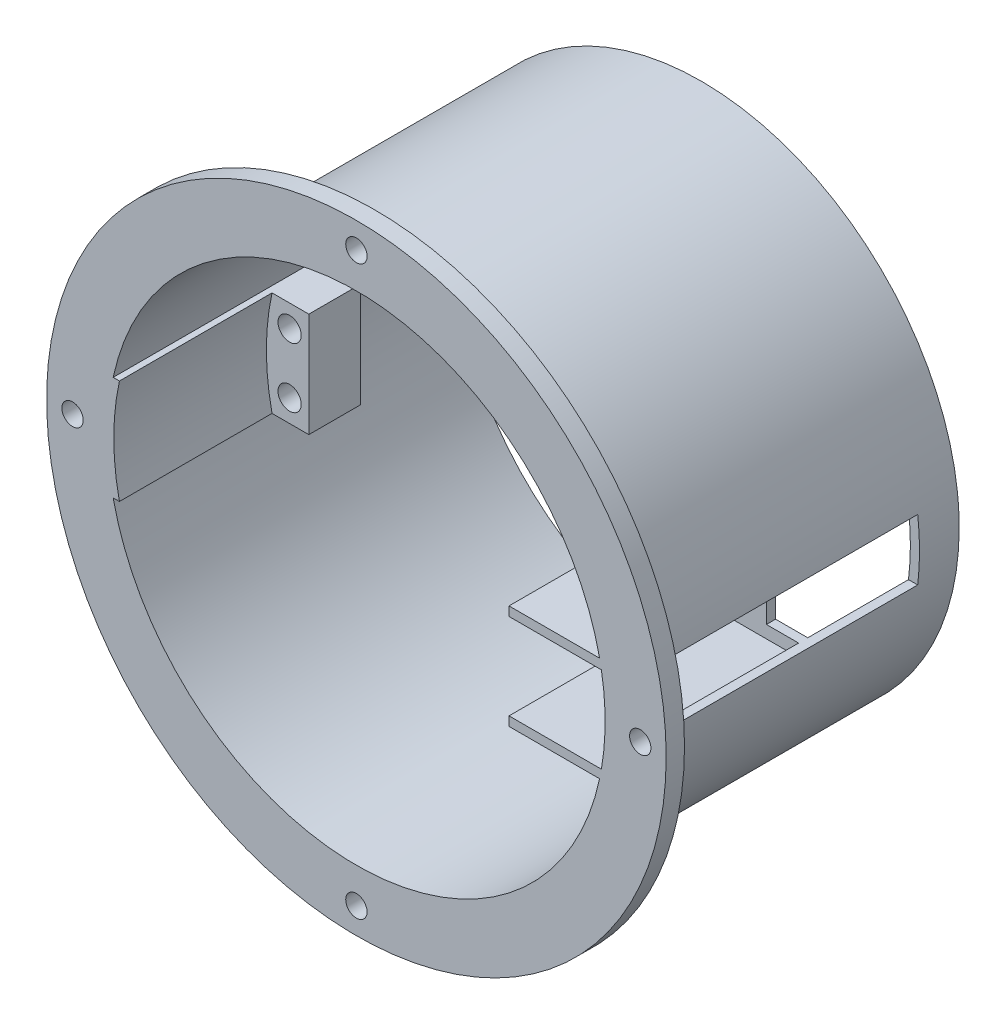
ISO-10303-21;
HEADER;
FILE_DESCRIPTION(('STEP AP214'),'2;1');
FILE_NAME('part.step','',(''),(''),'','','');
FILE_SCHEMA(('AUTOMOTIVE_DESIGN { 1 0 10303 214 1 1 1 1 }'));
ENDSEC;
DATA;
#1=APPLICATION_CONTEXT('core data for automotive mechanical design processes');
#2=APPLICATION_PROTOCOL_DEFINITION('international standard','automotive_design',2000,#1);
#3=PRODUCT_CONTEXT('',#1,'mechanical');
#4=PRODUCT('Part','Part','',(#3));
#5=PRODUCT_RELATED_PRODUCT_CATEGORY('part','',(#4));
#6=PRODUCT_DEFINITION_FORMATION('','',#4);
#7=PRODUCT_DEFINITION_CONTEXT('part definition',#1,'design');
#8=PRODUCT_DEFINITION('design','',#6,#7);
#9=PRODUCT_DEFINITION_SHAPE('','',#8);
#10=(LENGTH_UNIT() NAMED_UNIT(*) SI_UNIT(.MILLI.,.METRE.));
#11=(NAMED_UNIT(*) PLANE_ANGLE_UNIT() SI_UNIT($,.RADIAN.));
#12=(NAMED_UNIT(*) SI_UNIT($,.STERADIAN.) SOLID_ANGLE_UNIT());
#13=UNCERTAINTY_MEASURE_WITH_UNIT(LENGTH_MEASURE(1.E-05),#10,'distance_accuracy_value','');
#14=(GEOMETRIC_REPRESENTATION_CONTEXT(3) GLOBAL_UNCERTAINTY_ASSIGNED_CONTEXT((#13)) GLOBAL_UNIT_ASSIGNED_CONTEXT((#10,
#11,#12)) REPRESENTATION_CONTEXT('',''));
#15=CARTESIAN_POINT('',(0.,0.,0.));
#16=DIRECTION('',(0.,0.,1.));
#17=DIRECTION('',(1.,0.,0.));
#18=AXIS2_PLACEMENT_3D('',#15,#16,#17);
#19=CARTESIAN_POINT('',(0.,8.55,61.5));
#20=DIRECTION('',(0.,1.,0.));
#21=DIRECTION('',(0.,0.,1.));
#22=AXIS2_PLACEMENT_3D('',#19,#20,#21);
#23=PLANE('',#22);
#24=DIRECTION('',(0.,0.,-1.));
#25=VECTOR('',#24,1.);
#26=CARTESIAN_POINT('',(-32.79287166,8.55,112.118371577613));
#27=LINE('',#26,#25);
#28=CARTESIAN_POINT('',(-32.79287166,8.54999999999999,70.));
#29=VERTEX_POINT('',#28);
#30=CARTESIAN_POINT('',(-32.79287166,8.55,61.5));
#31=VERTEX_POINT('',#30);
#32=EDGE_CURVE('E57',#29,#31,#27,.T.);
#33=ORIENTED_EDGE('',*,*,#32,.T.);
#34=DIRECTION('',(-1.,0.,0.));
#35=VECTOR('',#34,1.);
#36=CARTESIAN_POINT('',(0.,8.55,61.5));
#37=LINE('',#36,#35);
#38=CARTESIAN_POINT('',(-39.842941658467,8.55,61.5));
#39=VERTEX_POINT('',#38);
#40=EDGE_CURVE('E235',#31,#39,#37,.T.);
#41=ORIENTED_EDGE('',*,*,#40,.T.);
#42=DIRECTION('',(0.,0.,1.));
#43=VECTOR('',#42,1.);
#44=CARTESIAN_POINT('',(-39.842941658467,8.55,61.5));
#45=LINE('',#44,#43);
#46=CARTESIAN_POINT('',(-39.842941658467,8.54999999999999,95.));
#47=VERTEX_POINT('',#46);
#48=EDGE_CURVE('E227',#39,#47,#45,.T.);
#49=ORIENTED_EDGE('',*,*,#48,.T.);
#50=DIRECTION('',(-1.,0.,0.));
#51=VECTOR('',#50,1.);
#52=CARTESIAN_POINT('',(-39.842941658467,8.54999999999999,95.));
#53=LINE('',#52,#51);
#54=CARTESIAN_POINT('',(-38.8195826870924,8.55,95.));
#55=VERTEX_POINT('',#54);
#56=EDGE_CURVE('E490',#55,#47,#53,.T.);
#57=ORIENTED_EDGE('',*,*,#56,.F.);
#58=DIRECTION('',(0.,0.,1.));
#59=VECTOR('',#58,1.);
#60=CARTESIAN_POINT('',(-38.8195826870924,8.55,52.791382652811));
#61=LINE('',#60,#59);
#62=CARTESIAN_POINT('',(-38.8195826870924,8.54999999999999,70.));
#63=VERTEX_POINT('',#62);
#64=EDGE_CURVE('E303',#63,#55,#61,.T.);
#65=ORIENTED_EDGE('',*,*,#64,.F.);
#66=DIRECTION('',(-1.,0.,0.));
#67=VECTOR('',#66,1.);
#68=CARTESIAN_POINT('',(-39.842941658467,8.54999999999999,70.));
#69=LINE('',#68,#67);
#70=EDGE_CURVE('E299',#29,#63,#69,.T.);
#71=ORIENTED_EDGE('',*,*,#70,.F.);
#72=EDGE_LOOP('',(#33,#41,#49,#57,#65,#71));
#73=FACE_BOUND('',#72,.T.);
#74=ADVANCED_FACE('F35',(#73),#23,.T.);
#75=CARTESIAN_POINT('',(0.,-8.55,61.5));
#76=DIRECTION('',(0.,1.,0.));
#77=DIRECTION('',(0.,0.,1.));
#78=AXIS2_PLACEMENT_3D('',#75,#76,#77);
#79=PLANE('',#78);
#80=DIRECTION('',(-1.,0.,0.));
#81=VECTOR('',#80,1.);
#82=CARTESIAN_POINT('',(0.,-8.55,61.5));
#83=LINE('',#82,#81);
#84=CARTESIAN_POINT('',(-32.79287166,-8.55,61.5));
#85=VERTEX_POINT('',#84);
#86=CARTESIAN_POINT('',(-39.842941658467,-8.55,61.5));
#87=VERTEX_POINT('',#86);
#88=EDGE_CURVE('E223',#85,#87,#83,.T.);
#89=ORIENTED_EDGE('',*,*,#88,.F.);
#90=DIRECTION('',(0.,0.,-1.));
#91=VECTOR('',#90,1.);
#92=CARTESIAN_POINT('',(-32.79287166,-8.55,112.118371577613));
#93=LINE('',#92,#91);
#94=CARTESIAN_POINT('',(-32.79287166,-8.55,70.));
#95=VERTEX_POINT('',#94);
#96=EDGE_CURVE('E281',#95,#85,#93,.T.);
#97=ORIENTED_EDGE('',*,*,#96,.F.);
#98=DIRECTION('',(1.,0.,0.));
#99=VECTOR('',#98,1.);
#100=CARTESIAN_POINT('',(-32.,-8.55,70.));
#101=LINE('',#100,#99);
#102=CARTESIAN_POINT('',(-38.8195826870924,-8.55,70.));
#103=VERTEX_POINT('',#102);
#104=EDGE_CURVE('E289',#103,#95,#101,.T.);
#105=ORIENTED_EDGE('',*,*,#104,.F.);
#106=DIRECTION('',(0.,0.,1.));
#107=VECTOR('',#106,1.);
#108=CARTESIAN_POINT('',(-38.8195826870924,-8.55,52.791382652811));
#109=LINE('',#108,#107);
#110=CARTESIAN_POINT('',(-38.8195826870924,-8.55,95.));
#111=VERTEX_POINT('',#110);
#112=EDGE_CURVE('E493',#103,#111,#109,.T.);
#113=ORIENTED_EDGE('',*,*,#112,.T.);
#114=DIRECTION('',(1.,0.,0.));
#115=VECTOR('',#114,1.);
#116=CARTESIAN_POINT('',(-39.842941658467,-8.55,95.));
#117=LINE('',#116,#115);
#118=CARTESIAN_POINT('',(-39.842941658467,-8.55,95.));
#119=VERTEX_POINT('',#118);
#120=EDGE_CURVE('E278',#119,#111,#117,.T.);
#121=ORIENTED_EDGE('',*,*,#120,.F.);
#122=DIRECTION('',(0.,0.,1.));
#123=VECTOR('',#122,1.);
#124=CARTESIAN_POINT('',(-39.842941658467,-8.55,61.5));
#125=LINE('',#124,#123);
#126=EDGE_CURVE('E222',#87,#119,#125,.T.);
#127=ORIENTED_EDGE('',*,*,#126,.F.);
#128=EDGE_LOOP('',(#89,#97,#105,#113,#121,#127));
#129=FACE_BOUND('',#128,.T.);
#130=ADVANCED_FACE('F288',(#129),#79,.F.);
#131=CARTESIAN_POINT('',(0.,0.,95.));
#132=DIRECTION('',(0.,0.,1.));
#133=DIRECTION('',(1.,0.,0.));
#134=AXIS2_PLACEMENT_3D('',#131,#132,#133);
#135=PLANE('',#134);
#136=CARTESIAN_POINT('',(46.5,0.,95.));
#137=DIRECTION('',(0.,0.,1.));
#138=DIRECTION('',(1.,0.,0.));
#139=AXIS2_PLACEMENT_3D('',#136,#137,#138);
#140=CIRCLE('',#139,1.75);
#141=CARTESIAN_POINT('',(48.25,0.,95.));
#142=VERTEX_POINT('',#141);
#143=EDGE_CURVE('E339',#142,#142,#140,.T.);
#144=ORIENTED_EDGE('',*,*,#143,.F.);
#145=EDGE_LOOP('',(#144));
#146=FACE_BOUND('',#145,.T.);
#147=CARTESIAN_POINT('',(0.,46.5,95.));
#148=DIRECTION('',(0.,0.,1.));
#149=DIRECTION('',(1.,0.,0.));
#150=AXIS2_PLACEMENT_3D('',#147,#148,#149);
#151=CIRCLE('',#150,1.75000000000005);
#152=CARTESIAN_POINT('',(1.75000000000006,46.5,95.));
#153=VERTEX_POINT('',#152);
#154=EDGE_CURVE('E336',#153,#153,#151,.T.);
#155=ORIENTED_EDGE('',*,*,#154,.F.);
#156=EDGE_LOOP('',(#155));
#157=FACE_BOUND('',#156,.T.);
#158=CARTESIAN_POINT('',(-46.5,-3.24707764512412E-13,95.));
#159=DIRECTION('',(0.,0.,1.));
#160=DIRECTION('',(1.,0.,0.));
#161=AXIS2_PLACEMENT_3D('',#158,#159,#160);
#162=CIRCLE('',#161,1.75000000000001);
#163=CARTESIAN_POINT('',(-44.75,-3.24707764512412E-13,95.));
#164=VERTEX_POINT('',#163);
#165=EDGE_CURVE('E333',#164,#164,#162,.T.);
#166=ORIENTED_EDGE('',*,*,#165,.F.);
#167=EDGE_LOOP('',(#166));
#168=FACE_BOUND('',#167,.T.);
#169=CARTESIAN_POINT('',(0.,-46.5,95.));
#170=DIRECTION('',(0.,0.,1.));
#171=DIRECTION('',(1.,0.,0.));
#172=AXIS2_PLACEMENT_3D('',#169,#170,#171);
#173=CIRCLE('',#172,1.75000000000015);
#174=CARTESIAN_POINT('',(1.75000000000013,-46.5,95.));
#175=VERTEX_POINT('',#174);
#176=EDGE_CURVE('E322',#175,#175,#173,.T.);
#177=ORIENTED_EDGE('',*,*,#176,.F.);
#178=EDGE_LOOP('',(#177));
#179=FACE_BOUND('',#178,.T.);
#180=CARTESIAN_POINT('',(0.,0.,95.));
#181=DIRECTION('',(0.,0.,1.));
#182=DIRECTION('',(1.,0.,0.));
#183=AXIS2_PLACEMENT_3D('',#180,#181,#182);
#184=CIRCLE('',#183,50.75);
#185=CARTESIAN_POINT('',(50.75,0.,95.));
#186=VERTEX_POINT('',#185);
#187=EDGE_CURVE('E345',#186,#186,#184,.T.);
#188=ORIENTED_EDGE('',*,*,#187,.T.);
#189=EDGE_LOOP('',(#188));
#190=FACE_BOUND('',#189,.T.);
#191=DIRECTION('',(1.,0.,0.));
#192=VECTOR('',#191,1.);
#193=CARTESIAN_POINT('',(0.,-8.55,95.));
#194=LINE('',#193,#192);
#195=CARTESIAN_POINT('',(25.,-8.55,95.));
#196=VERTEX_POINT('',#195);
#197=CARTESIAN_POINT('',(39.842941658467,-8.55,95.));
#198=VERTEX_POINT('',#197);
#199=EDGE_CURVE('E425',#196,#198,#194,.T.);
#200=ORIENTED_EDGE('',*,*,#199,.T.);
#201=CARTESIAN_POINT('',(0.,0.,95.));
#202=DIRECTION('',(0.,0.,1.));
#203=DIRECTION('',(1.,0.,0.));
#204=AXIS2_PLACEMENT_3D('',#201,#202,#203);
#205=CIRCLE('',#204,40.75);
#206=EDGE_CURVE('E415',#119,#198,#205,.T.);
#207=ORIENTED_EDGE('',*,*,#206,.F.);
#208=ORIENTED_EDGE('',*,*,#120,.T.);
#209=CARTESIAN_POINT('',(0.,0.,95.));
#210=DIRECTION('',(0.,0.,-1.));
#211=DIRECTION('',(1.,0.,0.));
#212=AXIS2_PLACEMENT_3D('',#209,#210,#211);
#213=CIRCLE('',#212,39.75);
#214=EDGE_CURVE('E487',#111,#55,#213,.T.);
#215=ORIENTED_EDGE('',*,*,#214,.T.);
#216=ORIENTED_EDGE('',*,*,#56,.T.);
#217=CARTESIAN_POINT('',(39.842941658467,8.54999999999999,95.));
#218=VERTEX_POINT('',#217);
#219=EDGE_CURVE('E411',#218,#47,#205,.T.);
#220=ORIENTED_EDGE('',*,*,#219,.F.);
#221=DIRECTION('',(-1.,0.,0.));
#222=VECTOR('',#221,1.);
#223=CARTESIAN_POINT('',(0.,8.55,95.));
#224=LINE('',#223,#222);
#225=CARTESIAN_POINT('',(25.,8.55,95.));
#226=VERTEX_POINT('',#225);
#227=EDGE_CURVE('E422',#218,#226,#224,.T.);
#228=ORIENTED_EDGE('',*,*,#227,.T.);
#229=DIRECTION('',(0.,1.,0.));
#230=VECTOR('',#229,1.);
#231=CARTESIAN_POINT('',(25.,0.,95.));
#232=LINE('',#231,#230);
#233=CARTESIAN_POINT('',(25.,7.04999999999999,95.));
#234=VERTEX_POINT('',#233);
#235=EDGE_CURVE('E250',#234,#226,#232,.T.);
#236=ORIENTED_EDGE('',*,*,#235,.F.);
#237=DIRECTION('',(-1.,0.,0.));
#238=VECTOR('',#237,1.);
#239=CARTESIAN_POINT('',(0.,7.04999999999999,95.));
#240=LINE('',#239,#238);
#241=CARTESIAN_POINT('',(40.1355204276711,7.04999999999999,95.));
#242=VERTEX_POINT('',#241);
#243=EDGE_CURVE('E419',#242,#234,#240,.T.);
#244=ORIENTED_EDGE('',*,*,#243,.F.);
#245=CARTESIAN_POINT('',(0.,0.,95.));
#246=DIRECTION('',(0.,0.,1.));
#247=DIRECTION('',(1.,0.,0.));
#248=AXIS2_PLACEMENT_3D('',#245,#246,#247);
#249=CIRCLE('',#248,40.75);
#250=CARTESIAN_POINT('',(40.1355204276711,-7.05,95.));
#251=VERTEX_POINT('',#250);
#252=EDGE_CURVE('E414',#251,#242,#249,.T.);
#253=ORIENTED_EDGE('',*,*,#252,.F.);
#254=DIRECTION('',(1.,0.,0.));
#255=VECTOR('',#254,1.);
#256=CARTESIAN_POINT('',(0.,-7.05,95.));
#257=LINE('',#256,#255);
#258=CARTESIAN_POINT('',(25.,-7.05,95.));
#259=VERTEX_POINT('',#258);
#260=EDGE_CURVE('E417',#259,#251,#257,.T.);
#261=ORIENTED_EDGE('',*,*,#260,.F.);
#262=EDGE_CURVE('E252',#196,#259,#232,.T.);
#263=ORIENTED_EDGE('',*,*,#262,.F.);
#264=EDGE_LOOP('',(#200,#207,#208,#215,#216,#220,#228,#236,#244,#253,#261,#263));
#265=FACE_BOUND('',#264,.T.);
#266=ADVANCED_FACE('F502',(#146,#157,#168,#179,#190,#265),#135,.T.);
#267=CARTESIAN_POINT('',(0.,0.,61.5));
#268=DIRECTION('',(0.,0.,-1.));
#269=DIRECTION('',(-1.,0.,0.));
#270=AXIS2_PLACEMENT_3D('',#267,#268,#269);
#271=CYLINDRICAL_SURFACE('',#270,42.25);
#272=CARTESIAN_POINT('',(0.,0.,38.5));
#273=DIRECTION('',(0.,0.,1.));
#274=DIRECTION('',(1.,0.,0.));
#275=AXIS2_PLACEMENT_3D('',#272,#273,#274);
#276=CIRCLE('',#275,42.25);
#277=CARTESIAN_POINT('',(42.25,0.,38.5));
#278=VERTEX_POINT('',#277);
#279=EDGE_CURVE('E247',#278,#278,#276,.T.);
#280=ORIENTED_EDGE('',*,*,#279,.T.);
#281=EDGE_LOOP('',(#280));
#282=FACE_BOUND('',#281,.T.);
#283=CARTESIAN_POINT('',(0.,0.,92.));
#284=DIRECTION('',(0.,0.,1.));
#285=DIRECTION('',(1.,0.,0.));
#286=AXIS2_PLACEMENT_3D('',#283,#284,#285);
#287=CIRCLE('',#286,42.25);
#288=CARTESIAN_POINT('',(41.953098812841,5.00000000000015,92.));
#289=VERTEX_POINT('',#288);
#290=CARTESIAN_POINT('',(41.953098812841,-4.99999999999985,92.));
#291=VERTEX_POINT('',#290);
#292=EDGE_CURVE('E349',#289,#291,#287,.T.);
#293=ORIENTED_EDGE('',*,*,#292,.F.);
#294=DIRECTION('',(0.,0.,-1.));
#295=VECTOR('',#294,1.);
#296=CARTESIAN_POINT('',(41.953098812841,5.00000000000015,61.5));
#297=LINE('',#296,#295);
#298=CARTESIAN_POINT('',(41.953098812841,5.00000000000015,45.));
#299=VERTEX_POINT('',#298);
#300=EDGE_CURVE('E384',#289,#299,#297,.T.);
#301=ORIENTED_EDGE('',*,*,#300,.T.);
#302=CARTESIAN_POINT('',(0.,0.,45.));
#303=DIRECTION('',(0.,0.,1.));
#304=DIRECTION('',(1.,0.,0.));
#305=AXIS2_PLACEMENT_3D('',#302,#303,#304);
#306=CIRCLE('',#305,42.25);
#307=CARTESIAN_POINT('',(41.953098812841,-4.99999999999985,45.));
#308=VERTEX_POINT('',#307);
#309=EDGE_CURVE('E389',#308,#299,#306,.T.);
#310=ORIENTED_EDGE('',*,*,#309,.F.);
#311=DIRECTION('',(0.,0.,-1.));
#312=VECTOR('',#311,1.);
#313=CARTESIAN_POINT('',(41.953098812841,-4.99999999999985,61.5));
#314=LINE('',#313,#312);
#315=EDGE_CURVE('E373',#308,#291,#314,.F.);
#316=ORIENTED_EDGE('',*,*,#315,.T.);
#317=EDGE_LOOP('',(#293,#301,#310,#316));
#318=FACE_BOUND('',#317,.T.);
#319=ADVANCED_FACE('F37',(#282,#318),#271,.T.);
#320=CARTESIAN_POINT('',(35.169284064653,5.00000000000015,45.));
#321=DIRECTION('',(0.,1.,0.));
#322=DIRECTION('',(0.,0.,1.));
#323=AXIS2_PLACEMENT_3D('',#320,#321,#322);
#324=PLANE('',#323);
#325=DIRECTION('',(1.,0.,0.));
#326=VECTOR('',#325,1.);
#327=CARTESIAN_POINT('',(35.169284064653,5.00000000000015,92.));
#328=LINE('',#327,#326);
#329=CARTESIAN_POINT('',(40.4420882250163,5.00000000000015,92.));
#330=VERTEX_POINT('',#329);
#331=EDGE_CURVE('E354',#330,#289,#328,.T.);
#332=ORIENTED_EDGE('',*,*,#331,.F.);
#333=DIRECTION('',(0.,0.,-1.));
#334=VECTOR('',#333,1.);
#335=CARTESIAN_POINT('',(40.4420882250163,5.00000000000015,95.));
#336=LINE('',#335,#334);
#337=CARTESIAN_POINT('',(40.4420882250163,5.00000000000015,63.));
#338=VERTEX_POINT('',#337);
#339=EDGE_CURVE('E376',#330,#338,#336,.T.);
#340=ORIENTED_EDGE('',*,*,#339,.T.);
#341=DIRECTION('',(-1.,0.,0.));
#342=VECTOR('',#341,1.);
#343=CARTESIAN_POINT('',(0.,5.00000000000015,63.));
#344=LINE('',#343,#342);
#345=CARTESIAN_POINT('',(35.169284064653,5.00000000000015,63.));
#346=VERTEX_POINT('',#345);
#347=EDGE_CURVE('E258',#338,#346,#344,.T.);
#348=ORIENTED_EDGE('',*,*,#347,.T.);
#349=DIRECTION('',(0.,0.,1.));
#350=VECTOR('',#349,1.);
#351=CARTESIAN_POINT('',(35.169284064653,5.00000000000015,45.));
#352=LINE('',#351,#350);
#353=CARTESIAN_POINT('',(35.169284064653,5.00000000000015,61.5));
#354=VERTEX_POINT('',#353);
#355=EDGE_CURVE('E363',#354,#346,#352,.T.);
#356=ORIENTED_EDGE('',*,*,#355,.F.);
#357=DIRECTION('',(-1.,0.,0.));
#358=VECTOR('',#357,1.);
#359=CARTESIAN_POINT('',(0.,5.00000000000015,61.5));
#360=LINE('',#359,#358);
#361=CARTESIAN_POINT('',(40.4420882250163,5.00000000000015,61.5));
#362=VERTEX_POINT('',#361);
#363=EDGE_CURVE('E381',#362,#354,#360,.T.);
#364=ORIENTED_EDGE('',*,*,#363,.F.);
#365=DIRECTION('',(0.,0.,-1.));
#366=VECTOR('',#365,1.);
#367=CARTESIAN_POINT('',(40.4420882250163,5.00000000000015,61.5));
#368=LINE('',#367,#366);
#369=CARTESIAN_POINT('',(40.4420882250163,5.00000000000015,45.));
#370=VERTEX_POINT('',#369);
#371=EDGE_CURVE('E378',#362,#370,#368,.T.);
#372=ORIENTED_EDGE('',*,*,#371,.T.);
#373=DIRECTION('',(-1.,0.,0.));
#374=VECTOR('',#373,1.);
#375=CARTESIAN_POINT('',(35.169284064653,5.00000000000015,45.));
#376=LINE('',#375,#374);
#377=EDGE_CURVE('E360',#299,#370,#376,.T.);
#378=ORIENTED_EDGE('',*,*,#377,.F.);
#379=ORIENTED_EDGE('',*,*,#300,.F.);
#380=EDGE_LOOP('',(#332,#340,#348,#356,#364,#372,#378,#379));
#381=FACE_BOUND('',#380,.T.);
#382=ADVANCED_FACE('F557',(#381),#324,.F.);
#383=CARTESIAN_POINT('',(35.169284064653,-4.99999999999985,45.));
#384=DIRECTION('',(0.,-1.,0.));
#385=DIRECTION('',(0.,0.,-1.));
#386=AXIS2_PLACEMENT_3D('',#383,#384,#385);
#387=PLANE('',#386);
#388=DIRECTION('',(-1.,0.,0.));
#389=VECTOR('',#388,1.);
#390=CARTESIAN_POINT('',(35.169284064653,-4.99999999999985,92.));
#391=LINE('',#390,#389);
#392=CARTESIAN_POINT('',(40.4420882250163,-4.99999999999985,92.));
#393=VERTEX_POINT('',#392);
#394=EDGE_CURVE('E263',#291,#393,#391,.T.);
#395=ORIENTED_EDGE('',*,*,#394,.F.);
#396=ORIENTED_EDGE('',*,*,#315,.F.);
#397=DIRECTION('',(1.,0.,0.));
#398=VECTOR('',#397,1.);
#399=CARTESIAN_POINT('',(35.169284064653,-4.99999999999985,45.));
#400=LINE('',#399,#398);
#401=CARTESIAN_POINT('',(40.4420882250163,-4.99999999999985,45.));
#402=VERTEX_POINT('',#401);
#403=EDGE_CURVE('E357',#402,#308,#400,.T.);
#404=ORIENTED_EDGE('',*,*,#403,.F.);
#405=DIRECTION('',(0.,0.,-1.));
#406=VECTOR('',#405,1.);
#407=CARTESIAN_POINT('',(40.4420882250163,-4.99999999999985,61.5));
#408=LINE('',#407,#406);
#409=CARTESIAN_POINT('',(40.4420882250163,-4.99999999999985,61.5));
#410=VERTEX_POINT('',#409);
#411=EDGE_CURVE('E369',#402,#410,#408,.F.);
#412=ORIENTED_EDGE('',*,*,#411,.T.);
#413=DIRECTION('',(1.,0.,0.));
#414=VECTOR('',#413,1.);
#415=CARTESIAN_POINT('',(0.,-4.99999999999985,61.5));
#416=LINE('',#415,#414);
#417=CARTESIAN_POINT('',(35.169284064653,-4.99999999999985,61.5));
#418=VERTEX_POINT('',#417);
#419=EDGE_CURVE('E371',#418,#410,#416,.T.);
#420=ORIENTED_EDGE('',*,*,#419,.F.);
#421=DIRECTION('',(0.,0.,1.));
#422=VECTOR('',#421,1.);
#423=CARTESIAN_POINT('',(35.169284064653,-4.99999999999985,45.));
#424=LINE('',#423,#422);
#425=CARTESIAN_POINT('',(35.169284064653,-4.99999999999985,63.));
#426=VERTEX_POINT('',#425);
#427=EDGE_CURVE('E362',#418,#426,#424,.T.);
#428=ORIENTED_EDGE('',*,*,#427,.T.);
#429=DIRECTION('',(1.,0.,0.));
#430=VECTOR('',#429,1.);
#431=CARTESIAN_POINT('',(0.,-4.99999999999985,63.));
#432=LINE('',#431,#430);
#433=CARTESIAN_POINT('',(40.4420882250163,-4.99999999999985,63.));
#434=VERTEX_POINT('',#433);
#435=EDGE_CURVE('E253',#426,#434,#432,.T.);
#436=ORIENTED_EDGE('',*,*,#435,.T.);
#437=DIRECTION('',(0.,0.,-1.));
#438=VECTOR('',#437,1.);
#439=CARTESIAN_POINT('',(40.4420882250163,-4.99999999999985,95.));
#440=LINE('',#439,#438);
#441=EDGE_CURVE('E366',#434,#393,#440,.F.);
#442=ORIENTED_EDGE('',*,*,#441,.T.);
#443=EDGE_LOOP('',(#395,#396,#404,#412,#420,#428,#436,#442));
#444=FACE_BOUND('',#443,.T.);
#445=ADVANCED_FACE('F549',(#444),#387,.F.);
#446=CARTESIAN_POINT('',(0.,0.,61.5));
#447=DIRECTION('',(0.,0.,1.));
#448=DIRECTION('',(1.,0.,0.));
#449=AXIS2_PLACEMENT_3D('',#446,#447,#448);
#450=PLANE('',#449);
#451=CARTESIAN_POINT('',(14.94287166,-4.9,61.5));
#452=DIRECTION('',(0.,0.,-1.));
#453=DIRECTION('',(-1.,0.,0.));
#454=AXIS2_PLACEMENT_3D('',#451,#452,#453);
#455=CIRCLE('',#454,1.9);
#456=CARTESIAN_POINT('',(13.04287166,-4.9,61.5));
#457=VERTEX_POINT('',#456);
#458=EDGE_CURVE('E475',#457,#457,#455,.T.);
#459=ORIENTED_EDGE('',*,*,#458,.F.);
#460=EDGE_LOOP('',(#459));
#461=FACE_BOUND('',#460,.T.);
#462=CARTESIAN_POINT('',(14.94287166,4.9,61.5));
#463=DIRECTION('',(0.,0.,-1.));
#464=DIRECTION('',(-1.,0.,0.));
#465=AXIS2_PLACEMENT_3D('',#462,#463,#464);
#466=CIRCLE('',#465,1.9);
#467=CARTESIAN_POINT('',(13.04287166,4.9,61.5));
#468=VERTEX_POINT('',#467);
#469=EDGE_CURVE('E270',#468,#468,#466,.T.);
#470=ORIENTED_EDGE('',*,*,#469,.F.);
#471=EDGE_LOOP('',(#470));
#472=FACE_BOUND('',#471,.T.);
#473=DIRECTION('',(1.,0.,0.));
#474=VECTOR('',#473,1.);
#475=CARTESIAN_POINT('',(0.,-8.55,61.5));
#476=LINE('',#475,#474);
#477=CARTESIAN_POINT('',(11.79287166,-8.55,61.5));
#478=VERTEX_POINT('',#477);
#479=CARTESIAN_POINT('',(39.842941658467,-8.55,61.5));
#480=VERTEX_POINT('',#479);
#481=EDGE_CURVE('E211',#478,#480,#476,.T.);
#482=ORIENTED_EDGE('',*,*,#481,.F.);
#483=DIRECTION('',(0.,-1.,0.));
#484=VECTOR('',#483,1.);
#485=CARTESIAN_POINT('',(11.79287166,8.54999999999999,61.5));
#486=LINE('',#485,#484);
#487=CARTESIAN_POINT('',(11.79287166,8.54999999999999,61.5));
#488=VERTEX_POINT('',#487);
#489=EDGE_CURVE('E199',#488,#478,#486,.T.);
#490=ORIENTED_EDGE('',*,*,#489,.F.);
#491=DIRECTION('',(1.,0.,0.));
#492=VECTOR('',#491,1.);
#493=CARTESIAN_POINT('',(0.,8.55,61.5));
#494=LINE('',#493,#492);
#495=CARTESIAN_POINT('',(39.842941658467,8.54999999999999,61.5));
#496=VERTEX_POINT('',#495);
#497=EDGE_CURVE('E233',#488,#496,#494,.T.);
#498=ORIENTED_EDGE('',*,*,#497,.T.);
#499=CARTESIAN_POINT('',(0.,0.,61.5));
#500=DIRECTION('',(0.,0.,1.));
#501=DIRECTION('',(1.,0.,0.));
#502=AXIS2_PLACEMENT_3D('',#499,#500,#501);
#503=CIRCLE('',#502,40.75);
#504=EDGE_CURVE('E231',#362,#496,#503,.T.);
#505=ORIENTED_EDGE('',*,*,#504,.F.);
#506=ORIENTED_EDGE('',*,*,#363,.T.);
#507=DIRECTION('',(0.,-1.,0.));
#508=VECTOR('',#507,1.);
#509=CARTESIAN_POINT('',(35.169284064653,0.,61.5));
#510=LINE('',#509,#508);
#511=EDGE_CURVE('E386',#354,#418,#510,.T.);
#512=ORIENTED_EDGE('',*,*,#511,.T.);
#513=ORIENTED_EDGE('',*,*,#419,.T.);
#514=EDGE_CURVE('E221',#480,#410,#503,.T.);
#515=ORIENTED_EDGE('',*,*,#514,.F.);
#516=EDGE_LOOP('',(#482,#490,#498,#505,#506,#512,#513,#515));
#517=FACE_BOUND('',#516,.T.);
#518=ADVANCED_FACE('F218',(#461,#472,#517),#450,.F.);
#519=CARTESIAN_POINT('',(0.,0.,38.5));
#520=DIRECTION('',(0.,0.,1.));
#521=DIRECTION('',(1.,0.,0.));
#522=AXIS2_PLACEMENT_3D('',#519,#520,#521);
#523=PLANE('',#522);
#524=ORIENTED_EDGE('',*,*,#279,.F.);
#525=EDGE_LOOP('',(#524));
#526=FACE_BOUND('',#525,.T.);
#527=CARTESIAN_POINT('',(0.,0.,38.5));
#528=DIRECTION('',(0.,0.,1.));
#529=DIRECTION('',(1.,0.,0.));
#530=AXIS2_PLACEMENT_3D('',#527,#528,#529);
#531=CIRCLE('',#530,40.75);
#532=CARTESIAN_POINT('',(40.75,0.,38.5));
#533=VERTEX_POINT('',#532);
#534=EDGE_CURVE('E244',#533,#533,#531,.T.);
#535=ORIENTED_EDGE('',*,*,#534,.T.);
#536=EDGE_LOOP('',(#535));
#537=FACE_BOUND('',#536,.T.);
#538=ADVANCED_FACE('F543',(#526,#537),#523,.F.);
#539=CARTESIAN_POINT('',(0.,0.,61.5));
#540=DIRECTION('',(0.,0.,-1.));
#541=DIRECTION('',(-1.,0.,0.));
#542=AXIS2_PLACEMENT_3D('',#539,#540,#541);
#543=CYLINDRICAL_SURFACE('',#542,40.75);
#544=ORIENTED_EDGE('',*,*,#219,.T.);
#545=ORIENTED_EDGE('',*,*,#48,.F.);
#546=EDGE_CURVE('E243',#39,#87,#503,.T.);
#547=ORIENTED_EDGE('',*,*,#546,.T.);
#548=ORIENTED_EDGE('',*,*,#126,.T.);
#549=ORIENTED_EDGE('',*,*,#206,.T.);
#550=DIRECTION('',(0.,0.,1.));
#551=VECTOR('',#550,1.);
#552=CARTESIAN_POINT('',(39.842941658467,-8.55,61.5));
#553=LINE('',#552,#551);
#554=EDGE_CURVE('E225',#480,#198,#553,.T.);
#555=ORIENTED_EDGE('',*,*,#554,.F.);
#556=ORIENTED_EDGE('',*,*,#514,.T.);
#557=ORIENTED_EDGE('',*,*,#411,.F.);
#558=CARTESIAN_POINT('',(0.,0.,45.));
#559=DIRECTION('',(0.,0.,1.));
#560=DIRECTION('',(1.,0.,0.));
#561=AXIS2_PLACEMENT_3D('',#558,#559,#560);
#562=CIRCLE('',#561,40.75);
#563=EDGE_CURVE('E260',#402,#370,#562,.T.);
#564=ORIENTED_EDGE('',*,*,#563,.T.);
#565=ORIENTED_EDGE('',*,*,#371,.F.);
#566=ORIENTED_EDGE('',*,*,#504,.T.);
#567=DIRECTION('',(0.,0.,1.));
#568=VECTOR('',#567,1.);
#569=CARTESIAN_POINT('',(39.842941658467,8.54999999999999,61.5));
#570=LINE('',#569,#568);
#571=EDGE_CURVE('E238',#496,#218,#570,.T.);
#572=ORIENTED_EDGE('',*,*,#571,.T.);
#573=EDGE_LOOP('',(#544,#545,#547,#548,#549,#555,#556,#557,#564,#565,#566,#572));
#574=FACE_BOUND('',#573,.T.);
#575=ORIENTED_EDGE('',*,*,#534,.F.);
#576=EDGE_LOOP('',(#575));
#577=FACE_BOUND('',#576,.T.);
#578=ADVANCED_FACE('F505',(#574,#577),#543,.F.);
#579=CARTESIAN_POINT('',(-35.94287166,4.9,61.5));
#580=DIRECTION('',(0.,0.,-1.));
#581=DIRECTION('',(-1.,0.,0.));
#582=AXIS2_PLACEMENT_3D('',#579,#580,#581);
#583=CIRCLE('',#582,1.9);
#584=CARTESIAN_POINT('',(-37.84287166,4.9,61.5));
#585=VERTEX_POINT('',#584);
#586=EDGE_CURVE('E215',#585,#585,#583,.T.);
#587=ORIENTED_EDGE('',*,*,#586,.F.);
#588=EDGE_LOOP('',(#587));
#589=FACE_BOUND('',#588,.T.);
#590=CARTESIAN_POINT('',(-35.94287166,-4.9,61.5));
#591=DIRECTION('',(0.,0.,-1.));
#592=DIRECTION('',(-1.,0.,0.));
#593=AXIS2_PLACEMENT_3D('',#590,#591,#592);
#594=CIRCLE('',#593,1.9);
#595=CARTESIAN_POINT('',(-37.84287166,-4.9,61.5));
#596=VERTEX_POINT('',#595);
#597=EDGE_CURVE('E478',#596,#596,#594,.T.);
#598=ORIENTED_EDGE('',*,*,#597,.F.);
#599=EDGE_LOOP('',(#598));
#600=FACE_BOUND('',#599,.T.);
#601=ORIENTED_EDGE('',*,*,#40,.F.);
#602=DIRECTION('',(0.,1.,0.));
#603=VECTOR('',#602,1.);
#604=CARTESIAN_POINT('',(-32.79287166,8.55,61.5));
#605=LINE('',#604,#603);
#606=EDGE_CURVE('E292',#85,#31,#605,.T.);
#607=ORIENTED_EDGE('',*,*,#606,.F.);
#608=ORIENTED_EDGE('',*,*,#88,.T.);
#609=ORIENTED_EDGE('',*,*,#546,.F.);
#610=EDGE_LOOP('',(#601,#607,#608,#609));
#611=FACE_BOUND('',#610,.T.);
#612=ADVANCED_FACE('F525',(#589,#600,#611),#450,.F.);
#613=CARTESIAN_POINT('',(0.,8.55,61.5));
#614=DIRECTION('',(0.,-1.,0.));
#615=DIRECTION('',(1.,0.,0.));
#616=AXIS2_PLACEMENT_3D('',#613,#614,#615);
#617=PLANE('',#616);
#618=ORIENTED_EDGE('',*,*,#497,.F.);
#619=DIRECTION('',(0.,0.,-1.));
#620=VECTOR('',#619,1.);
#621=CARTESIAN_POINT('',(11.79287166,8.54999999999999,112.118371577613));
#622=LINE('',#621,#620);
#623=CARTESIAN_POINT('',(11.79287166,8.54999999999999,70.));
#624=VERTEX_POINT('',#623);
#625=EDGE_CURVE('E202',#624,#488,#622,.T.);
#626=ORIENTED_EDGE('',*,*,#625,.F.);
#627=DIRECTION('',(-1.,0.,0.));
#628=VECTOR('',#627,1.);
#629=CARTESIAN_POINT('',(0.,8.55,70.));
#630=LINE('',#629,#628);
#631=CARTESIAN_POINT('',(25.,8.55,70.));
#632=VERTEX_POINT('',#631);
#633=EDGE_CURVE('E407',#632,#624,#630,.T.);
#634=ORIENTED_EDGE('',*,*,#633,.F.);
#635=DIRECTION('',(0.,0.,1.));
#636=VECTOR('',#635,1.);
#637=CARTESIAN_POINT('',(25.,8.54999999999999,61.5));
#638=LINE('',#637,#636);
#639=EDGE_CURVE('E403',#632,#226,#638,.T.);
#640=ORIENTED_EDGE('',*,*,#639,.T.);
#641=ORIENTED_EDGE('',*,*,#227,.F.);
#642=ORIENTED_EDGE('',*,*,#571,.F.);
#643=EDGE_LOOP('',(#618,#626,#634,#640,#641,#642));
#644=FACE_BOUND('',#643,.T.);
#645=ADVANCED_FACE('F469',(#644),#617,.F.);
#646=CARTESIAN_POINT('',(0.,-8.55,61.5));
#647=DIRECTION('',(0.,-1.,0.));
#648=DIRECTION('',(0.,0.,-1.));
#649=AXIS2_PLACEMENT_3D('',#646,#647,#648);
#650=PLANE('',#649);
#651=DIRECTION('',(0.,0.,-1.));
#652=VECTOR('',#651,1.);
#653=CARTESIAN_POINT('',(11.79287166,-8.55,112.118371577613));
#654=LINE('',#653,#652);
#655=CARTESIAN_POINT('',(11.79287166,-8.55,70.));
#656=VERTEX_POINT('',#655);
#657=EDGE_CURVE('E49',#656,#478,#654,.T.);
#658=ORIENTED_EDGE('',*,*,#657,.T.);
#659=ORIENTED_EDGE('',*,*,#481,.T.);
#660=ORIENTED_EDGE('',*,*,#554,.T.);
#661=ORIENTED_EDGE('',*,*,#199,.F.);
#662=DIRECTION('',(0.,0.,1.));
#663=VECTOR('',#662,1.);
#664=CARTESIAN_POINT('',(25.,-8.55,61.5));
#665=LINE('',#664,#663);
#666=CARTESIAN_POINT('',(25.,-8.55,70.));
#667=VERTEX_POINT('',#666);
#668=EDGE_CURVE('E401',#667,#196,#665,.T.);
#669=ORIENTED_EDGE('',*,*,#668,.F.);
#670=DIRECTION('',(-1.,0.,0.));
#671=VECTOR('',#670,1.);
#672=CARTESIAN_POINT('',(0.,-8.55,70.));
#673=LINE('',#672,#671);
#674=EDGE_CURVE('E214',#667,#656,#673,.T.);
#675=ORIENTED_EDGE('',*,*,#674,.T.);
#676=EDGE_LOOP('',(#658,#659,#660,#661,#669,#675));
#677=FACE_BOUND('',#676,.T.);
#678=ADVANCED_FACE('F209',(#677),#650,.T.);
#679=CARTESIAN_POINT('',(0.,0.,95.));
#680=DIRECTION('',(0.,0.,-1.));
#681=DIRECTION('',(-1.,0.,0.));
#682=AXIS2_PLACEMENT_3D('',#679,#680,#681);
#683=CYLINDRICAL_SURFACE('',#682,40.75);
#684=CARTESIAN_POINT('',(0.,0.,92.));
#685=DIRECTION('',(0.,0.,1.));
#686=DIRECTION('',(1.,0.,0.));
#687=AXIS2_PLACEMENT_3D('',#684,#685,#686);
#688=CIRCLE('',#687,40.75);
#689=EDGE_CURVE('E342',#393,#330,#688,.T.);
#690=ORIENTED_EDGE('',*,*,#689,.F.);
#691=ORIENTED_EDGE('',*,*,#441,.F.);
#692=CARTESIAN_POINT('',(0.,0.,63.));
#693=DIRECTION('',(0.,0.,1.));
#694=DIRECTION('',(1.,0.,0.));
#695=AXIS2_PLACEMENT_3D('',#692,#693,#694);
#696=CIRCLE('',#695,40.75);
#697=CARTESIAN_POINT('',(40.1355204276711,-7.05,63.));
#698=VERTEX_POINT('',#697);
#699=EDGE_CURVE('E429',#698,#434,#696,.T.);
#700=ORIENTED_EDGE('',*,*,#699,.F.);
#701=DIRECTION('',(0.,0.,-1.));
#702=VECTOR('',#701,1.);
#703=CARTESIAN_POINT('',(40.1355204276711,-7.05,95.));
#704=LINE('',#703,#702);
#705=EDGE_CURVE('E236',#251,#698,#704,.T.);
#706=ORIENTED_EDGE('',*,*,#705,.F.);
#707=ORIENTED_EDGE('',*,*,#252,.T.);
#708=DIRECTION('',(0.,0.,-1.));
#709=VECTOR('',#708,1.);
#710=CARTESIAN_POINT('',(40.1355204276711,7.04999999999999,95.));
#711=LINE('',#710,#709);
#712=CARTESIAN_POINT('',(40.1355204276711,7.04999999999999,63.));
#713=VERTEX_POINT('',#712);
#714=EDGE_CURVE('E428',#242,#713,#711,.T.);
#715=ORIENTED_EDGE('',*,*,#714,.T.);
#716=EDGE_CURVE('E410',#338,#713,#696,.T.);
#717=ORIENTED_EDGE('',*,*,#716,.F.);
#718=ORIENTED_EDGE('',*,*,#339,.F.);
#719=EDGE_LOOP('',(#690,#691,#700,#706,#707,#715,#717,#718));
#720=FACE_BOUND('',#719,.T.);
#721=ADVANCED_FACE('F448',(#720),#683,.F.);
#722=CARTESIAN_POINT('',(0.,-7.05,95.));
#723=DIRECTION('',(0.,1.,0.));
#724=DIRECTION('',(0.,0.,1.));
#725=AXIS2_PLACEMENT_3D('',#722,#723,#724);
#726=PLANE('',#725);
#727=DIRECTION('',(0.,0.,-1.));
#728=VECTOR('',#727,1.);
#729=CARTESIAN_POINT('',(25.,-7.05,95.));
#730=LINE('',#729,#728);
#731=CARTESIAN_POINT('',(25.,-7.05,70.));
#732=VERTEX_POINT('',#731);
#733=CARTESIAN_POINT('',(25.,-7.05,63.));
#734=VERTEX_POINT('',#733);
#735=EDGE_CURVE('E315',#732,#734,#730,.T.);
#736=ORIENTED_EDGE('',*,*,#735,.F.);
#737=DIRECTION('',(0.,0.,-1.));
#738=VECTOR('',#737,1.);
#739=CARTESIAN_POINT('',(25.,-7.05,95.));
#740=LINE('',#739,#738);
#741=EDGE_CURVE('E398',#259,#732,#740,.T.);
#742=ORIENTED_EDGE('',*,*,#741,.F.);
#743=ORIENTED_EDGE('',*,*,#260,.T.);
#744=ORIENTED_EDGE('',*,*,#705,.T.);
#745=DIRECTION('',(1.,0.,0.));
#746=VECTOR('',#745,1.);
#747=CARTESIAN_POINT('',(0.,-7.05,63.));
#748=LINE('',#747,#746);
#749=EDGE_CURVE('E432',#734,#698,#748,.T.);
#750=ORIENTED_EDGE('',*,*,#749,.F.);
#751=EDGE_LOOP('',(#736,#742,#743,#744,#750));
#752=FACE_BOUND('',#751,.T.);
#753=ADVANCED_FACE('F441',(#752),#726,.T.);
#754=CARTESIAN_POINT('',(0.,7.04999999999999,95.));
#755=DIRECTION('',(0.,-1.,0.));
#756=DIRECTION('',(0.,0.,-1.));
#757=AXIS2_PLACEMENT_3D('',#754,#755,#756);
#758=PLANE('',#757);
#759=DIRECTION('',(0.,0.,1.));
#760=VECTOR('',#759,1.);
#761=CARTESIAN_POINT('',(25.,7.04999999999999,95.));
#762=LINE('',#761,#760);
#763=CARTESIAN_POINT('',(25.,7.04999999999999,63.));
#764=VERTEX_POINT('',#763);
#765=CARTESIAN_POINT('',(25.,7.04999999999999,70.));
#766=VERTEX_POINT('',#765);
#767=EDGE_CURVE('E312',#764,#766,#762,.T.);
#768=ORIENTED_EDGE('',*,*,#767,.F.);
#769=DIRECTION('',(-1.,0.,0.));
#770=VECTOR('',#769,1.);
#771=CARTESIAN_POINT('',(0.,7.04999999999999,63.));
#772=LINE('',#771,#770);
#773=EDGE_CURVE('E434',#713,#764,#772,.T.);
#774=ORIENTED_EDGE('',*,*,#773,.F.);
#775=ORIENTED_EDGE('',*,*,#714,.F.);
#776=ORIENTED_EDGE('',*,*,#243,.T.);
#777=DIRECTION('',(0.,0.,1.));
#778=VECTOR('',#777,1.);
#779=CARTESIAN_POINT('',(25.,7.04999999999999,95.));
#780=LINE('',#779,#778);
#781=EDGE_CURVE('E396',#766,#234,#780,.T.);
#782=ORIENTED_EDGE('',*,*,#781,.F.);
#783=EDGE_LOOP('',(#768,#774,#775,#776,#782));
#784=FACE_BOUND('',#783,.T.);
#785=ADVANCED_FACE('F513',(#784),#758,.T.);
#786=CARTESIAN_POINT('',(0.,0.,63.));
#787=DIRECTION('',(0.,0.,1.));
#788=DIRECTION('',(1.,0.,0.));
#789=AXIS2_PLACEMENT_3D('',#786,#787,#788);
#790=PLANE('',#789);
#791=DIRECTION('',(0.,1.,0.));
#792=VECTOR('',#791,1.);
#793=CARTESIAN_POINT('',(25.,0.,63.));
#794=LINE('',#793,#792);
#795=EDGE_CURVE('E309',#734,#764,#794,.T.);
#796=ORIENTED_EDGE('',*,*,#795,.F.);
#797=ORIENTED_EDGE('',*,*,#749,.T.);
#798=ORIENTED_EDGE('',*,*,#699,.T.);
#799=ORIENTED_EDGE('',*,*,#435,.F.);
#800=DIRECTION('',(0.,-1.,0.));
#801=VECTOR('',#800,1.);
#802=CARTESIAN_POINT('',(35.169284064653,0.,63.));
#803=LINE('',#802,#801);
#804=EDGE_CURVE('E255',#346,#426,#803,.T.);
#805=ORIENTED_EDGE('',*,*,#804,.F.);
#806=ORIENTED_EDGE('',*,*,#347,.F.);
#807=ORIENTED_EDGE('',*,*,#716,.T.);
#808=ORIENTED_EDGE('',*,*,#773,.T.);
#809=EDGE_LOOP('',(#796,#797,#798,#799,#805,#806,#807,#808));
#810=FACE_BOUND('',#809,.T.);
#811=ADVANCED_FACE('F451',(#810),#790,.T.);
#812=CARTESIAN_POINT('',(0.,0.,70.));
#813=DIRECTION('',(0.,0.,1.));
#814=DIRECTION('',(1.,0.,0.));
#815=AXIS2_PLACEMENT_3D('',#812,#813,#814);
#816=PLANE('',#815);
#817=DIRECTION('',(0.,1.,0.));
#818=VECTOR('',#817,1.);
#819=CARTESIAN_POINT('',(11.79287166,0.,70.));
#820=LINE('',#819,#818);
#821=EDGE_CURVE('E11',#656,#624,#820,.T.);
#822=ORIENTED_EDGE('',*,*,#821,.F.);
#823=ORIENTED_EDGE('',*,*,#674,.F.);
#824=DIRECTION('',(0.,1.,0.));
#825=VECTOR('',#824,1.);
#826=CARTESIAN_POINT('',(25.,10.,70.));
#827=LINE('',#826,#825);
#828=EDGE_CURVE('E395',#667,#732,#827,.T.);
#829=ORIENTED_EDGE('',*,*,#828,.T.);
#830=DIRECTION('',(0.,1.,0.));
#831=VECTOR('',#830,1.);
#832=CARTESIAN_POINT('',(25.,8.55,70.));
#833=LINE('',#832,#831);
#834=EDGE_CURVE('E301',#732,#766,#833,.T.);
#835=ORIENTED_EDGE('',*,*,#834,.T.);
#836=EDGE_CURVE('E392',#766,#632,#827,.T.);
#837=ORIENTED_EDGE('',*,*,#836,.T.);
#838=ORIENTED_EDGE('',*,*,#633,.T.);
#839=EDGE_LOOP('',(#822,#823,#829,#835,#837,#838));
#840=FACE_BOUND('',#839,.T.);
#841=CARTESIAN_POINT('',(14.94287166,-4.9,70.));
#842=DIRECTION('',(0.,0.,1.));
#843=DIRECTION('',(1.,0.,0.));
#844=AXIS2_PLACEMENT_3D('',#841,#842,#843);
#845=CIRCLE('',#844,1.9);
#846=CARTESIAN_POINT('',(16.84287166,-4.9,70.));
#847=VERTEX_POINT('',#846);
#848=EDGE_CURVE('E276',#847,#847,#845,.T.);
#849=ORIENTED_EDGE('',*,*,#848,.F.);
#850=EDGE_LOOP('',(#849));
#851=FACE_BOUND('',#850,.T.);
#852=CARTESIAN_POINT('',(14.94287166,4.9,70.));
#853=DIRECTION('',(0.,0.,1.));
#854=DIRECTION('',(1.,0.,0.));
#855=AXIS2_PLACEMENT_3D('',#852,#853,#854);
#856=CIRCLE('',#855,1.9);
#857=CARTESIAN_POINT('',(16.84287166,4.9,70.));
#858=VERTEX_POINT('',#857);
#859=EDGE_CURVE('E273',#858,#858,#856,.T.);
#860=ORIENTED_EDGE('',*,*,#859,.F.);
#861=EDGE_LOOP('',(#860));
#862=FACE_BOUND('',#861,.T.);
#863=ADVANCED_FACE('F465',(#840,#851,#862),#816,.T.);
#864=CARTESIAN_POINT('',(25.,10.,70.));
#865=DIRECTION('',(1.,0.,0.));
#866=DIRECTION('',(0.,0.,-1.));
#867=AXIS2_PLACEMENT_3D('',#864,#865,#866);
#868=PLANE('',#867);
#869=ORIENTED_EDGE('',*,*,#836,.F.);
#870=ORIENTED_EDGE('',*,*,#781,.T.);
#871=ORIENTED_EDGE('',*,*,#235,.T.);
#872=ORIENTED_EDGE('',*,*,#639,.F.);
#873=EDGE_LOOP('',(#869,#870,#871,#872));
#874=FACE_BOUND('',#873,.T.);
#875=ADVANCED_FACE('F516',(#874),#868,.F.);
#876=ORIENTED_EDGE('',*,*,#668,.T.);
#877=ORIENTED_EDGE('',*,*,#262,.T.);
#878=ORIENTED_EDGE('',*,*,#741,.T.);
#879=ORIENTED_EDGE('',*,*,#828,.F.);
#880=EDGE_LOOP('',(#876,#877,#878,#879));
#881=FACE_BOUND('',#880,.T.);
#882=ADVANCED_FACE('F462',(#881),#868,.F.);
#883=CARTESIAN_POINT('',(0.,0.,45.));
#884=DIRECTION('',(0.,0.,1.));
#885=DIRECTION('',(1.,0.,0.));
#886=AXIS2_PLACEMENT_3D('',#883,#884,#885);
#887=PLANE('',#886);
#888=ORIENTED_EDGE('',*,*,#309,.T.);
#889=ORIENTED_EDGE('',*,*,#377,.T.);
#890=ORIENTED_EDGE('',*,*,#563,.F.);
#891=ORIENTED_EDGE('',*,*,#403,.T.);
#892=EDGE_LOOP('',(#888,#889,#890,#891));
#893=FACE_BOUND('',#892,.T.);
#894=ADVANCED_FACE('F574',(#893),#887,.T.);
#895=CARTESIAN_POINT('',(35.169284064653,5.00000000000015,45.));
#896=DIRECTION('',(-1.,0.,0.));
#897=DIRECTION('',(0.,0.,1.));
#898=AXIS2_PLACEMENT_3D('',#895,#896,#897);
#899=PLANE('',#898);
#900=ORIENTED_EDGE('',*,*,#355,.T.);
#901=ORIENTED_EDGE('',*,*,#804,.T.);
#902=ORIENTED_EDGE('',*,*,#427,.F.);
#903=ORIENTED_EDGE('',*,*,#511,.F.);
#904=EDGE_LOOP('',(#900,#901,#902,#903));
#905=FACE_BOUND('',#904,.T.);
#906=ADVANCED_FACE('F569',(#905),#899,.F.);
#907=CARTESIAN_POINT('',(0.,0.,92.));
#908=DIRECTION('',(0.,0.,1.));
#909=DIRECTION('',(1.,0.,0.));
#910=AXIS2_PLACEMENT_3D('',#907,#908,#909);
#911=PLANE('',#910);
#912=CARTESIAN_POINT('',(46.5,0.,92.));
#913=DIRECTION('',(0.,0.,-1.));
#914=DIRECTION('',(-1.,0.,0.));
#915=AXIS2_PLACEMENT_3D('',#912,#913,#914);
#916=CIRCLE('',#915,1.75);
#917=CARTESIAN_POINT('',(44.75,0.,92.));
#918=VERTEX_POINT('',#917);
#919=EDGE_CURVE('E319',#918,#918,#916,.T.);
#920=ORIENTED_EDGE('',*,*,#919,.F.);
#921=EDGE_LOOP('',(#920));
#922=FACE_BOUND('',#921,.T.);
#923=CARTESIAN_POINT('',(0.,46.5,92.));
#924=DIRECTION('',(0.,0.,-1.));
#925=DIRECTION('',(-1.,0.,0.));
#926=AXIS2_PLACEMENT_3D('',#923,#924,#925);
#927=CIRCLE('',#926,1.75000000000005);
#928=CARTESIAN_POINT('',(-1.75000000000004,46.5,92.));
#929=VERTEX_POINT('',#928);
#930=EDGE_CURVE('E323',#929,#929,#927,.T.);
#931=ORIENTED_EDGE('',*,*,#930,.F.);
#932=EDGE_LOOP('',(#931));
#933=FACE_BOUND('',#932,.T.);
#934=CARTESIAN_POINT('',(-46.5,-3.24707764512412E-13,92.));
#935=DIRECTION('',(0.,0.,-1.));
#936=DIRECTION('',(-1.,0.,0.));
#937=AXIS2_PLACEMENT_3D('',#934,#935,#936);
#938=CIRCLE('',#937,1.75000000000001);
#939=CARTESIAN_POINT('',(-48.25,-3.24707764512412E-13,92.));
#940=VERTEX_POINT('',#939);
#941=EDGE_CURVE('E326',#940,#940,#938,.T.);
#942=ORIENTED_EDGE('',*,*,#941,.F.);
#943=EDGE_LOOP('',(#942));
#944=FACE_BOUND('',#943,.T.);
#945=CARTESIAN_POINT('',(0.,-46.5,92.));
#946=DIRECTION('',(0.,0.,-1.));
#947=DIRECTION('',(-1.,0.,0.));
#948=AXIS2_PLACEMENT_3D('',#945,#946,#947);
#949=CIRCLE('',#948,1.75000000000015);
#950=CARTESIAN_POINT('',(-1.75000000000016,-46.5,92.));
#951=VERTEX_POINT('',#950);
#952=EDGE_CURVE('E318',#951,#951,#949,.T.);
#953=ORIENTED_EDGE('',*,*,#952,.F.);
#954=EDGE_LOOP('',(#953));
#955=FACE_BOUND('',#954,.T.);
#956=CARTESIAN_POINT('',(0.,0.,92.));
#957=DIRECTION('',(0.,0.,1.));
#958=DIRECTION('',(1.,0.,0.));
#959=AXIS2_PLACEMENT_3D('',#956,#957,#958);
#960=CIRCLE('',#959,50.75);
#961=CARTESIAN_POINT('',(50.75,0.,92.));
#962=VERTEX_POINT('',#961);
#963=EDGE_CURVE('E346',#962,#962,#960,.T.);
#964=ORIENTED_EDGE('',*,*,#963,.F.);
#965=EDGE_LOOP('',(#964));
#966=FACE_BOUND('',#965,.T.);
#967=ORIENTED_EDGE('',*,*,#689,.T.);
#968=ORIENTED_EDGE('',*,*,#331,.T.);
#969=ORIENTED_EDGE('',*,*,#292,.T.);
#970=ORIENTED_EDGE('',*,*,#394,.T.);
#971=EDGE_LOOP('',(#967,#968,#969,#970));
#972=FACE_BOUND('',#971,.T.);
#973=ADVANCED_FACE('F564',(#922,#933,#944,#955,#966,#972),#911,.F.);
#974=CARTESIAN_POINT('',(0.,0.,92.));
#975=DIRECTION('',(0.,0.,1.));
#976=DIRECTION('',(1.,0.,0.));
#977=AXIS2_PLACEMENT_3D('',#974,#975,#976);
#978=CYLINDRICAL_SURFACE('',#977,50.75);
#979=ORIENTED_EDGE('',*,*,#963,.T.);
#980=EDGE_LOOP('',(#979));
#981=FACE_BOUND('',#980,.T.);
#982=ORIENTED_EDGE('',*,*,#187,.F.);
#983=EDGE_LOOP('',(#982));
#984=FACE_BOUND('',#983,.T.);
#985=ADVANCED_FACE('F585',(#981,#984),#978,.T.);
#986=CARTESIAN_POINT('',(0.,-46.5,101.5));
#987=DIRECTION('',(0.,0.,-1.));
#988=DIRECTION('',(-1.,0.,0.));
#989=AXIS2_PLACEMENT_3D('',#986,#987,#988);
#990=CYLINDRICAL_SURFACE('',#989,1.75000000000015);
#991=ORIENTED_EDGE('',*,*,#176,.T.);
#992=EDGE_LOOP('',(#991));
#993=FACE_BOUND('',#992,.T.);
#994=ORIENTED_EDGE('',*,*,#952,.T.);
#995=EDGE_LOOP('',(#994));
#996=FACE_BOUND('',#995,.T.);
#997=ADVANCED_FACE('F673',(#993,#996),#990,.F.);
#998=CARTESIAN_POINT('',(-46.5,-3.24707764512412E-13,101.5));
#999=DIRECTION('',(0.,0.,-1.));
#1000=DIRECTION('',(-1.,0.,0.));
#1001=AXIS2_PLACEMENT_3D('',#998,#999,#1000);
#1002=CYLINDRICAL_SURFACE('',#1001,1.75000000000001);
#1003=ORIENTED_EDGE('',*,*,#165,.T.);
#1004=EDGE_LOOP('',(#1003));
#1005=FACE_BOUND('',#1004,.T.);
#1006=ORIENTED_EDGE('',*,*,#941,.T.);
#1007=EDGE_LOOP('',(#1006));
#1008=FACE_BOUND('',#1007,.T.);
#1009=ADVANCED_FACE('F682',(#1005,#1008),#1002,.F.);
#1010=CARTESIAN_POINT('',(0.,46.5,101.5));
#1011=DIRECTION('',(0.,0.,-1.));
#1012=DIRECTION('',(-1.,0.,0.));
#1013=AXIS2_PLACEMENT_3D('',#1010,#1011,#1012);
#1014=CYLINDRICAL_SURFACE('',#1013,1.75000000000005);
#1015=ORIENTED_EDGE('',*,*,#154,.T.);
#1016=EDGE_LOOP('',(#1015));
#1017=FACE_BOUND('',#1016,.T.);
#1018=ORIENTED_EDGE('',*,*,#930,.T.);
#1019=EDGE_LOOP('',(#1018));
#1020=FACE_BOUND('',#1019,.T.);
#1021=ADVANCED_FACE('F692',(#1017,#1020),#1014,.F.);
#1022=CARTESIAN_POINT('',(46.5,0.,101.5));
#1023=DIRECTION('',(0.,0.,-1.));
#1024=DIRECTION('',(-1.,0.,0.));
#1025=AXIS2_PLACEMENT_3D('',#1022,#1023,#1024);
#1026=CYLINDRICAL_SURFACE('',#1025,1.75);
#1027=ORIENTED_EDGE('',*,*,#143,.T.);
#1028=EDGE_LOOP('',(#1027));
#1029=FACE_BOUND('',#1028,.T.);
#1030=ORIENTED_EDGE('',*,*,#919,.T.);
#1031=EDGE_LOOP('',(#1030));
#1032=FACE_BOUND('',#1031,.T.);
#1033=ADVANCED_FACE('F702',(#1029,#1032),#1026,.F.);
#1034=CARTESIAN_POINT('',(25.,8.55,39.4));
#1035=DIRECTION('',(1.,0.,0.));
#1036=DIRECTION('',(0.,0.,-1.));
#1037=AXIS2_PLACEMENT_3D('',#1034,#1035,#1036);
#1038=PLANE('',#1037);
#1039=ORIENTED_EDGE('',*,*,#834,.F.);
#1040=ORIENTED_EDGE('',*,*,#735,.T.);
#1041=ORIENTED_EDGE('',*,*,#795,.T.);
#1042=ORIENTED_EDGE('',*,*,#767,.T.);
#1043=EDGE_LOOP('',(#1039,#1040,#1041,#1042));
#1044=FACE_BOUND('',#1043,.T.);
#1045=ADVANCED_FACE('F458',(#1044),#1038,.T.);
#1046=CARTESIAN_POINT('',(0.,0.,70.));
#1047=DIRECTION('',(0.,0.,1.));
#1048=DIRECTION('',(1.,0.,0.));
#1049=AXIS2_PLACEMENT_3D('',#1046,#1047,#1048);
#1050=PLANE('',#1049);
#1051=DIRECTION('',(0.,-1.,0.));
#1052=VECTOR('',#1051,1.);
#1053=CARTESIAN_POINT('',(-32.79287166,0.,70.));
#1054=LINE('',#1053,#1052);
#1055=EDGE_CURVE('E43',#29,#95,#1054,.T.);
#1056=ORIENTED_EDGE('',*,*,#1055,.F.);
#1057=ORIENTED_EDGE('',*,*,#70,.T.);
#1058=CARTESIAN_POINT('',(0.,0.,70.));
#1059=DIRECTION('',(0.,0.,1.));
#1060=DIRECTION('',(1.,0.,0.));
#1061=AXIS2_PLACEMENT_3D('',#1058,#1059,#1060);
#1062=CIRCLE('',#1061,39.75);
#1063=EDGE_CURVE('E297',#63,#103,#1062,.T.);
#1064=ORIENTED_EDGE('',*,*,#1063,.T.);
#1065=ORIENTED_EDGE('',*,*,#104,.T.);
#1066=EDGE_LOOP('',(#1056,#1057,#1064,#1065));
#1067=FACE_BOUND('',#1066,.T.);
#1068=CARTESIAN_POINT('',(-35.94287166,4.9,70.));
#1069=DIRECTION('',(0.,0.,1.));
#1070=DIRECTION('',(1.,0.,0.));
#1071=AXIS2_PLACEMENT_3D('',#1068,#1069,#1070);
#1072=CIRCLE('',#1071,1.9);
#1073=CARTESIAN_POINT('',(-34.04287166,4.9,70.));
#1074=VERTEX_POINT('',#1073);
#1075=EDGE_CURVE('E269',#1074,#1074,#1072,.T.);
#1076=ORIENTED_EDGE('',*,*,#1075,.F.);
#1077=EDGE_LOOP('',(#1076));
#1078=FACE_BOUND('',#1077,.T.);
#1079=CARTESIAN_POINT('',(-35.94287166,-4.9,70.));
#1080=DIRECTION('',(0.,0.,1.));
#1081=DIRECTION('',(1.,0.,0.));
#1082=AXIS2_PLACEMENT_3D('',#1079,#1080,#1081);
#1083=CIRCLE('',#1082,1.9);
#1084=CARTESIAN_POINT('',(-34.04287166,-4.9,70.));
#1085=VERTEX_POINT('',#1084);
#1086=EDGE_CURVE('E266',#1085,#1085,#1083,.T.);
#1087=ORIENTED_EDGE('',*,*,#1086,.F.);
#1088=EDGE_LOOP('',(#1087));
#1089=FACE_BOUND('',#1088,.T.);
#1090=ADVANCED_FACE('F294',(#1067,#1078,#1089),#1050,.T.);
#1091=CARTESIAN_POINT('',(0.,0.,52.791382652811));
#1092=DIRECTION('',(0.,0.,1.));
#1093=DIRECTION('',(1.,0.,0.));
#1094=AXIS2_PLACEMENT_3D('',#1091,#1092,#1093);
#1095=CYLINDRICAL_SURFACE('',#1094,39.75);
#1096=ORIENTED_EDGE('',*,*,#1063,.F.);
#1097=ORIENTED_EDGE('',*,*,#64,.T.);
#1098=ORIENTED_EDGE('',*,*,#214,.F.);
#1099=ORIENTED_EDGE('',*,*,#112,.F.);
#1100=EDGE_LOOP('',(#1096,#1097,#1098,#1099));
#1101=FACE_BOUND('',#1100,.T.);
#1102=ADVANCED_FACE('F497',(#1101),#1095,.F.);
#1103=CARTESIAN_POINT('',(-35.94287166,-4.9,71.5));
#1104=DIRECTION('',(0.,0.,-1.));
#1105=DIRECTION('',(-1.,0.,0.));
#1106=AXIS2_PLACEMENT_3D('',#1103,#1104,#1105);
#1107=CYLINDRICAL_SURFACE('',#1106,1.9);
#1108=ORIENTED_EDGE('',*,*,#1086,.T.);
#1109=EDGE_LOOP('',(#1108));
#1110=FACE_BOUND('',#1109,.T.);
#1111=ORIENTED_EDGE('',*,*,#597,.T.);
#1112=EDGE_LOOP('',(#1111));
#1113=FACE_BOUND('',#1112,.T.);
#1114=ADVANCED_FACE('F742',(#1110,#1113),#1107,.F.);
#1115=CARTESIAN_POINT('',(-35.94287166,4.9,71.5));
#1116=DIRECTION('',(0.,0.,-1.));
#1117=DIRECTION('',(-1.,0.,0.));
#1118=AXIS2_PLACEMENT_3D('',#1115,#1116,#1117);
#1119=CYLINDRICAL_SURFACE('',#1118,1.9);
#1120=ORIENTED_EDGE('',*,*,#1075,.T.);
#1121=EDGE_LOOP('',(#1120));
#1122=FACE_BOUND('',#1121,.T.);
#1123=ORIENTED_EDGE('',*,*,#586,.T.);
#1124=EDGE_LOOP('',(#1123));
#1125=FACE_BOUND('',#1124,.T.);
#1126=ADVANCED_FACE('F751',(#1122,#1125),#1119,.F.);
#1127=CARTESIAN_POINT('',(14.94287166,4.9,71.5));
#1128=DIRECTION('',(0.,0.,-1.));
#1129=DIRECTION('',(-1.,0.,0.));
#1130=AXIS2_PLACEMENT_3D('',#1127,#1128,#1129);
#1131=CYLINDRICAL_SURFACE('',#1130,1.9);
#1132=ORIENTED_EDGE('',*,*,#859,.T.);
#1133=EDGE_LOOP('',(#1132));
#1134=FACE_BOUND('',#1133,.T.);
#1135=ORIENTED_EDGE('',*,*,#469,.T.);
#1136=EDGE_LOOP('',(#1135));
#1137=FACE_BOUND('',#1136,.T.);
#1138=ADVANCED_FACE('F761',(#1134,#1137),#1131,.F.);
#1139=CARTESIAN_POINT('',(14.94287166,-4.9,71.5));
#1140=DIRECTION('',(0.,0.,-1.));
#1141=DIRECTION('',(-1.,0.,0.));
#1142=AXIS2_PLACEMENT_3D('',#1139,#1140,#1141);
#1143=CYLINDRICAL_SURFACE('',#1142,1.9);
#1144=ORIENTED_EDGE('',*,*,#848,.T.);
#1145=EDGE_LOOP('',(#1144));
#1146=FACE_BOUND('',#1145,.T.);
#1147=ORIENTED_EDGE('',*,*,#458,.T.);
#1148=EDGE_LOOP('',(#1147));
#1149=FACE_BOUND('',#1148,.T.);
#1150=ADVANCED_FACE('F771',(#1146,#1149),#1143,.F.);
#1151=CARTESIAN_POINT('',(-32.79287166,8.55,112.118371577613));
#1152=DIRECTION('',(-1.,0.,0.));
#1153=DIRECTION('',(0.,0.,1.));
#1154=AXIS2_PLACEMENT_3D('',#1151,#1152,#1153);
#1155=PLANE('',#1154);
#1156=ORIENTED_EDGE('',*,*,#1055,.T.);
#1157=ORIENTED_EDGE('',*,*,#96,.T.);
#1158=ORIENTED_EDGE('',*,*,#606,.T.);
#1159=ORIENTED_EDGE('',*,*,#32,.F.);
#1160=EDGE_LOOP('',(#1156,#1157,#1158,#1159));
#1161=FACE_BOUND('',#1160,.T.);
#1162=ADVANCED_FACE('F280',(#1161),#1155,.F.);
#1163=CARTESIAN_POINT('',(11.79287166,8.54999999999999,112.118371577613));
#1164=DIRECTION('',(1.,0.,0.));
#1165=DIRECTION('',(0.,1.,0.));
#1166=AXIS2_PLACEMENT_3D('',#1163,#1164,#1165);
#1167=PLANE('',#1166);
#1168=ORIENTED_EDGE('',*,*,#821,.T.);
#1169=ORIENTED_EDGE('',*,*,#625,.T.);
#1170=ORIENTED_EDGE('',*,*,#489,.T.);
#1171=ORIENTED_EDGE('',*,*,#657,.F.);
#1172=EDGE_LOOP('',(#1168,#1169,#1170,#1171));
#1173=FACE_BOUND('',#1172,.T.);
#1174=ADVANCED_FACE('F200',(#1173),#1167,.F.);
#1175=CLOSED_SHELL('',(#74,#130,#266,#319,#382,#445,#518,#538,#578,#612,#645,#678,#721,#753,
#785,#811,#863,#875,#882,#894,#906,#973,#985,#997,#1009,#1021,#1033,#1045,#1090,#1102,#1114,
#1126,#1138,#1150,#1162,#1174));
#1176=MANIFOLD_SOLID_BREP('B2',#1175);
#1177=ADVANCED_BREP_SHAPE_REPRESENTATION('',(#18,#1176),#14);
#1178=SHAPE_DEFINITION_REPRESENTATION(#9,#1177);
ENDSEC;
END-ISO-10303-21;
